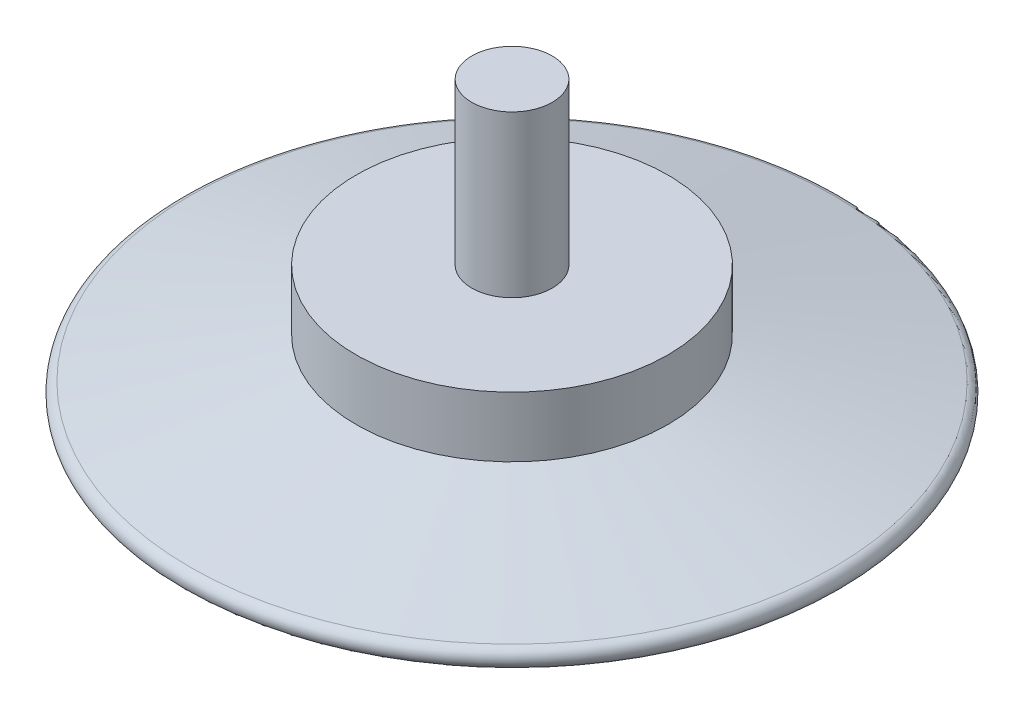
ISO-10303-21;
HEADER;
FILE_DESCRIPTION(('STEP AP214'),'2;1');
FILE_NAME('part.step','',(''),(''),'','','');
FILE_SCHEMA(('AUTOMOTIVE_DESIGN { 1 0 10303 214 1 1 1 1 }'));
ENDSEC;
DATA;
#1=APPLICATION_CONTEXT('core data for automotive mechanical design processes');
#2=APPLICATION_PROTOCOL_DEFINITION('international standard','automotive_design',2000,#1);
#3=PRODUCT_CONTEXT('',#1,'mechanical');
#4=PRODUCT('Part','Part','',(#3));
#5=PRODUCT_RELATED_PRODUCT_CATEGORY('part','',(#4));
#6=PRODUCT_DEFINITION_FORMATION('','',#4);
#7=PRODUCT_DEFINITION_CONTEXT('part definition',#1,'design');
#8=PRODUCT_DEFINITION('design','',#6,#7);
#9=PRODUCT_DEFINITION_SHAPE('','',#8);
#10=(LENGTH_UNIT() NAMED_UNIT(*) SI_UNIT(.MILLI.,.METRE.));
#11=(NAMED_UNIT(*) PLANE_ANGLE_UNIT() SI_UNIT($,.RADIAN.));
#12=(NAMED_UNIT(*) SI_UNIT($,.STERADIAN.) SOLID_ANGLE_UNIT());
#13=UNCERTAINTY_MEASURE_WITH_UNIT(LENGTH_MEASURE(1.E-05),#10,'distance_accuracy_value','');
#14=(GEOMETRIC_REPRESENTATION_CONTEXT(3) GLOBAL_UNCERTAINTY_ASSIGNED_CONTEXT((#13)) GLOBAL_UNIT_ASSIGNED_CONTEXT((#10,
#11,#12)) REPRESENTATION_CONTEXT('',''));
#15=CARTESIAN_POINT('',(0.,0.,0.));
#16=DIRECTION('',(0.,0.,1.));
#17=DIRECTION('',(1.,0.,0.));
#18=AXIS2_PLACEMENT_3D('',#15,#16,#17);
#19=CARTESIAN_POINT('',(0.,14.,0.));
#20=DIRECTION('',(0.,-1.,0.));
#21=DIRECTION('',(1.,0.,0.));
#22=AXIS2_PLACEMENT_3D('',#19,#20,#21);
#23=PLANE('',#22);
#24=CARTESIAN_POINT('',(0.,14.,0.));
#25=DIRECTION('',(0.,-1.,0.));
#26=DIRECTION('',(1.,0.,0.));
#27=AXIS2_PLACEMENT_3D('',#24,#25,#26);
#28=CIRCLE('',#27,2.);
#29=CARTESIAN_POINT('',(2.,14.,0.));
#30=VERTEX_POINT('',#29);
#31=EDGE_CURVE('E10',#30,#30,#28,.T.);
#32=ORIENTED_EDGE('',*,*,#31,.F.);
#33=EDGE_LOOP('',(#32));
#34=FACE_BOUND('',#33,.T.);
#35=ADVANCED_FACE('F34',(#34),#23,.F.);
#36=CARTESIAN_POINT('',(0.,0.,0.));
#37=DIRECTION('',(0.,-1.,0.));
#38=DIRECTION('',(1.,0.,0.));
#39=AXIS2_PLACEMENT_3D('',#36,#37,#38);
#40=CYLINDRICAL_SURFACE('',#39,2.);
#41=CARTESIAN_POINT('',(0.,6.,0.));
#42=DIRECTION('',(0.,-1.,0.));
#43=DIRECTION('',(1.,0.,0.));
#44=AXIS2_PLACEMENT_3D('',#41,#42,#43);
#45=CIRCLE('',#44,2.);
#46=CARTESIAN_POINT('',(2.,6.,0.));
#47=VERTEX_POINT('',#46);
#48=EDGE_CURVE('E40',#47,#47,#45,.T.);
#49=ORIENTED_EDGE('',*,*,#48,.F.);
#50=EDGE_LOOP('',(#49));
#51=FACE_BOUND('',#50,.T.);
#52=ORIENTED_EDGE('',*,*,#31,.T.);
#53=EDGE_LOOP('',(#52));
#54=FACE_BOUND('',#53,.T.);
#55=ADVANCED_FACE('F82',(#51,#54),#40,.T.);
#56=CARTESIAN_POINT('',(-2.,6.,0.));
#57=DIRECTION('',(0.,-1.,0.));
#58=DIRECTION('',(1.,0.,0.));
#59=AXIS2_PLACEMENT_3D('',#56,#57,#58);
#60=PLANE('',#59);
#61=CARTESIAN_POINT('',(0.,6.,0.));
#62=DIRECTION('',(0.,-1.,0.));
#63=DIRECTION('',(1.,0.,0.));
#64=AXIS2_PLACEMENT_3D('',#61,#62,#63);
#65=CIRCLE('',#64,7.75);
#66=CARTESIAN_POINT('',(7.75,6.,0.));
#67=VERTEX_POINT('',#66);
#68=EDGE_CURVE('E44',#67,#67,#65,.T.);
#69=ORIENTED_EDGE('',*,*,#68,.F.);
#70=EDGE_LOOP('',(#69));
#71=FACE_BOUND('',#70,.T.);
#72=ORIENTED_EDGE('',*,*,#48,.T.);
#73=EDGE_LOOP('',(#72));
#74=FACE_BOUND('',#73,.T.);
#75=ADVANCED_FACE('F77',(#71,#74),#60,.F.);
#76=CARTESIAN_POINT('',(0.,0.,0.));
#77=DIRECTION('',(0.,-1.,0.));
#78=DIRECTION('',(1.,0.,0.));
#79=AXIS2_PLACEMENT_3D('',#76,#77,#78);
#80=CYLINDRICAL_SURFACE('',#79,7.75);
#81=CARTESIAN_POINT('',(0.,3.,0.));
#82=DIRECTION('',(0.,-1.,0.));
#83=DIRECTION('',(1.,0.,0.));
#84=AXIS2_PLACEMENT_3D('',#81,#82,#83);
#85=CIRCLE('',#84,7.75);
#86=CARTESIAN_POINT('',(7.75,3.,0.));
#87=VERTEX_POINT('',#86);
#88=EDGE_CURVE('E48',#87,#87,#85,.T.);
#89=ORIENTED_EDGE('',*,*,#88,.F.);
#90=EDGE_LOOP('',(#89));
#91=FACE_BOUND('',#90,.T.);
#92=ORIENTED_EDGE('',*,*,#68,.T.);
#93=EDGE_LOOP('',(#92));
#94=FACE_BOUND('',#93,.T.);
#95=ADVANCED_FACE('F71',(#91,#94),#80,.T.);
#96=CARTESIAN_POINT('',(0.,3.,0.));
#97=DIRECTION('',(0.,-1.,0.));
#98=DIRECTION('',(1.,0.,0.));
#99=AXIS2_PLACEMENT_3D('',#96,#97,#98);
#100=CONICAL_SURFACE('',#99,7.75,1.33132759728292);
#101=CARTESIAN_POINT('',(0.,0.985732061078591,0.));
#102=DIRECTION('',(0.,-1.,0.));
#103=DIRECTION('',(1.,0.,0.));
#104=AXIS2_PLACEMENT_3D('',#101,#102,#103);
#105=CIRCLE('',#104,16.);
#106=CARTESIAN_POINT('',(16.,0.985732061078591,0.));
#107=VERTEX_POINT('',#106);
#108=EDGE_CURVE('E53',#107,#107,#105,.T.);
#109=ORIENTED_EDGE('',*,*,#108,.F.);
#110=EDGE_LOOP('',(#109));
#111=FACE_BOUND('',#110,.T.);
#112=ORIENTED_EDGE('',*,*,#88,.T.);
#113=EDGE_LOOP('',(#112));
#114=FACE_BOUND('',#113,.T.);
#115=ADVANCED_FACE('F65',(#111,#114),#100,.T.);
#116=CARTESIAN_POINT('',(0.,0.5,0.));
#117=DIRECTION('',(0.,-1.,0.));
#118=DIRECTION('',(1.,0.,0.));
#119=AXIS2_PLACEMENT_3D('',#116,#117,#118);
#120=TOROIDAL_SURFACE('',#119,15.8814067251471,0.500000000000001);
#121=CARTESIAN_POINT('',(0.,0.,0.));
#122=DIRECTION('',(0.,-1.,0.));
#123=DIRECTION('',(1.,0.,0.));
#124=AXIS2_PLACEMENT_3D('',#121,#122,#123);
#125=CIRCLE('',#124,15.8814067251471);
#126=CARTESIAN_POINT('',(15.8814067251471,0.,0.));
#127=VERTEX_POINT('',#126);
#128=EDGE_CURVE('E56',#127,#127,#125,.T.);
#129=ORIENTED_EDGE('',*,*,#128,.F.);
#130=EDGE_LOOP('',(#129));
#131=FACE_BOUND('',#130,.T.);
#132=ORIENTED_EDGE('',*,*,#108,.T.);
#133=EDGE_LOOP('',(#132));
#134=FACE_BOUND('',#133,.T.);
#135=ADVANCED_FACE('F62',(#131,#134),#120,.T.);
#136=CARTESIAN_POINT('',(-15.8814067251471,0.,0.));
#137=DIRECTION('',(0.,1.,0.));
#138=DIRECTION('',(-1.,0.,0.));
#139=AXIS2_PLACEMENT_3D('',#136,#137,#138);
#140=PLANE('',#139);
#141=ORIENTED_EDGE('',*,*,#128,.T.);
#142=EDGE_LOOP('',(#141));
#143=FACE_BOUND('',#142,.T.);
#144=ADVANCED_FACE('F60',(#143),#140,.F.);
#145=CLOSED_SHELL('',(#35,#55,#75,#95,#115,#135,#144));
#146=MANIFOLD_SOLID_BREP('B2',#145);
#147=ADVANCED_BREP_SHAPE_REPRESENTATION('',(#18,#146),#14);
#148=SHAPE_DEFINITION_REPRESENTATION(#9,#147);
ENDSEC;
END-ISO-10303-21;
